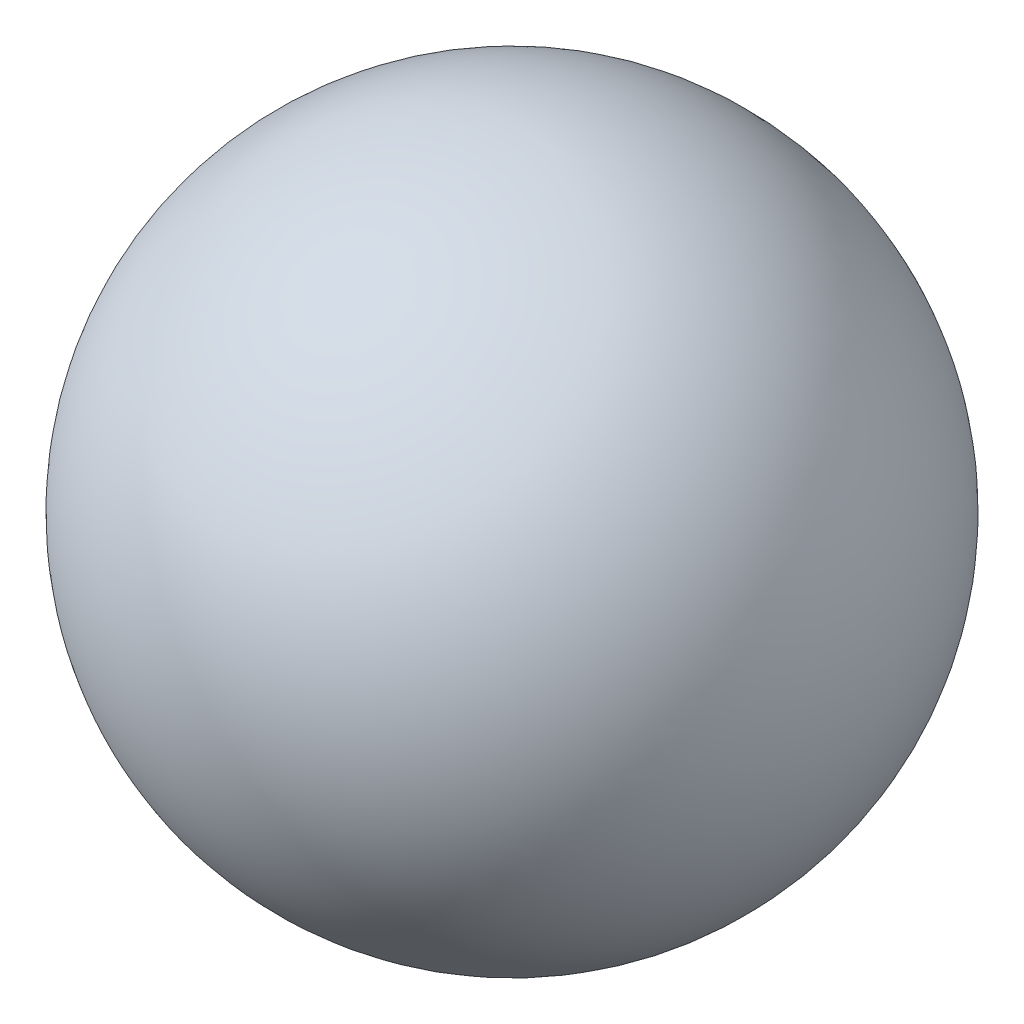
ISO-10303-21;
HEADER;
FILE_DESCRIPTION(('STEP AP214'),'2;1');
FILE_NAME('part.step','',(''),(''),'','','');
FILE_SCHEMA(('AUTOMOTIVE_DESIGN { 1 0 10303 214 1 1 1 1 }'));
ENDSEC;
DATA;
#1=APPLICATION_CONTEXT('core data for automotive mechanical design processes');
#2=APPLICATION_PROTOCOL_DEFINITION('international standard','automotive_design',2000,#1);
#3=PRODUCT_CONTEXT('',#1,'mechanical');
#4=PRODUCT('Part','Part','',(#3));
#5=PRODUCT_RELATED_PRODUCT_CATEGORY('part','',(#4));
#6=PRODUCT_DEFINITION_FORMATION('','',#4);
#7=PRODUCT_DEFINITION_CONTEXT('part definition',#1,'design');
#8=PRODUCT_DEFINITION('design','',#6,#7);
#9=PRODUCT_DEFINITION_SHAPE('','',#8);
#10=(LENGTH_UNIT() NAMED_UNIT(*) SI_UNIT(.MILLI.,.METRE.));
#11=(NAMED_UNIT(*) PLANE_ANGLE_UNIT() SI_UNIT($,.RADIAN.));
#12=(NAMED_UNIT(*) SI_UNIT($,.STERADIAN.) SOLID_ANGLE_UNIT());
#13=UNCERTAINTY_MEASURE_WITH_UNIT(LENGTH_MEASURE(1.E-05),#10,'distance_accuracy_value','');
#14=(GEOMETRIC_REPRESENTATION_CONTEXT(3) GLOBAL_UNCERTAINTY_ASSIGNED_CONTEXT((#13)) GLOBAL_UNIT_ASSIGNED_CONTEXT((#10,
#11,#12)) REPRESENTATION_CONTEXT('',''));
#15=CARTESIAN_POINT('',(0.,0.,0.));
#16=DIRECTION('',(0.,0.,1.));
#17=DIRECTION('',(1.,0.,0.));
#18=AXIS2_PLACEMENT_3D('',#15,#16,#17);
#19=CARTESIAN_POINT('',(64.16,0.60547321248372,-69.3803581079618));
#20=DIRECTION('',(0.,0.00872653549837389,-0.999961923064178));
#21=DIRECTION('',(0.173648177666935,0.984770254550592,0.00859395981573479));
#22=AXIS2_PLACEMENT_3D('',#19,#20,#21);
#23=SPHERICAL_SURFACE('',#22,7.15);
#24=CARTESIAN_POINT('',(64.16,0.543078483670301,-62.230630358053));
#25=VERTEX_POINT('',#24);
#26=VERTEX_LOOP('',#25);
#27=FACE_BOUND('',#26,.T.);
#28=CARTESIAN_POINT('',(64.16,0.667867941297029,-76.5300858578706));
#29=VERTEX_POINT('',#28);
#30=VERTEX_LOOP('',#29);
#31=FACE_BOUND('',#30,.T.);
#32=ADVANCED_FACE('F19',(#27,#31),#23,.T.);
#33=CLOSED_SHELL('',(#32));
#34=MANIFOLD_SOLID_BREP('B1',#33);
#35=ADVANCED_BREP_SHAPE_REPRESENTATION('',(#18,#34),#14);
#36=SHAPE_DEFINITION_REPRESENTATION(#9,#35);
ENDSEC;
END-ISO-10303-21;
